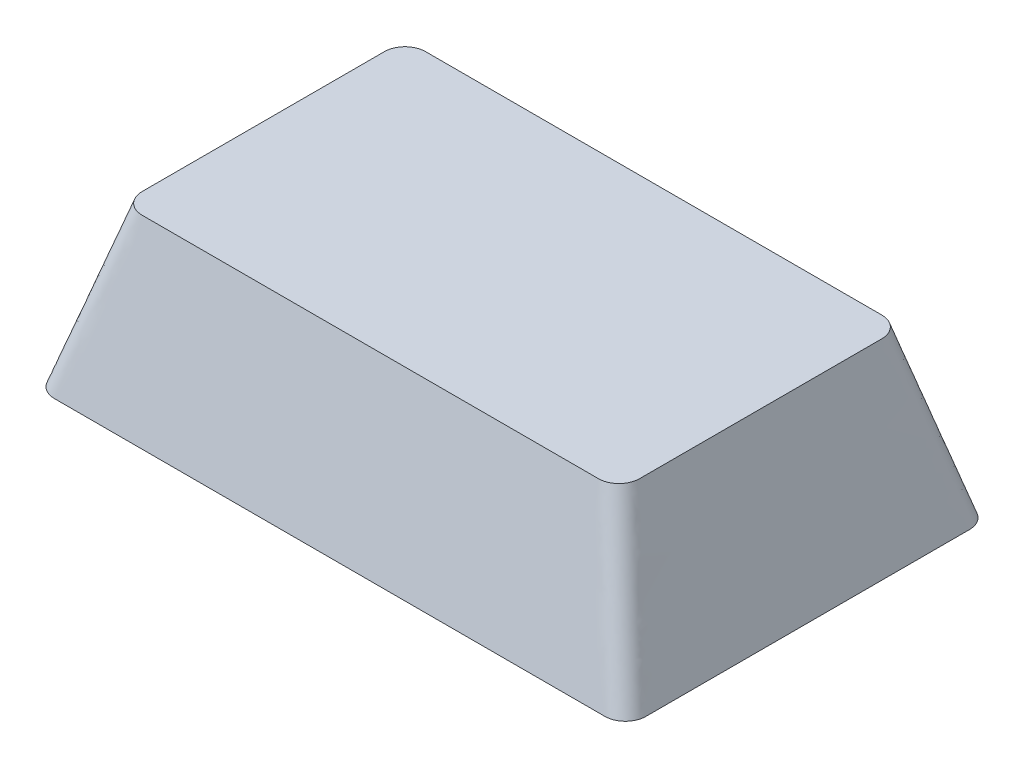
ISO-10303-21;
HEADER;
FILE_DESCRIPTION(('STEP AP214'),'2;1');
FILE_NAME('part.step','',(''),(''),'','','');
FILE_SCHEMA(('AUTOMOTIVE_DESIGN { 1 0 10303 214 1 1 1 1 }'));
ENDSEC;
DATA;
#1=APPLICATION_CONTEXT('core data for automotive mechanical design processes');
#2=APPLICATION_PROTOCOL_DEFINITION('international standard','automotive_design',2000,#1);
#3=PRODUCT_CONTEXT('',#1,'mechanical');
#4=PRODUCT('Part','Part','',(#3));
#5=PRODUCT_RELATED_PRODUCT_CATEGORY('part','',(#4));
#6=PRODUCT_DEFINITION_FORMATION('','',#4);
#7=PRODUCT_DEFINITION_CONTEXT('part definition',#1,'design');
#8=PRODUCT_DEFINITION('design','',#6,#7);
#9=PRODUCT_DEFINITION_SHAPE('','',#8);
#10=(LENGTH_UNIT() NAMED_UNIT(*) SI_UNIT(.MILLI.,.METRE.));
#11=(NAMED_UNIT(*) PLANE_ANGLE_UNIT() SI_UNIT($,.RADIAN.));
#12=(NAMED_UNIT(*) SI_UNIT($,.STERADIAN.) SOLID_ANGLE_UNIT());
#13=UNCERTAINTY_MEASURE_WITH_UNIT(LENGTH_MEASURE(1.E-05),#10,'distance_accuracy_value','');
#14=(GEOMETRIC_REPRESENTATION_CONTEXT(3) GLOBAL_UNCERTAINTY_ASSIGNED_CONTEXT((#13)) GLOBAL_UNIT_ASSIGNED_CONTEXT((#10,
#11,#12)) REPRESENTATION_CONTEXT('',''));
#15=CARTESIAN_POINT('',(0.,0.,0.));
#16=DIRECTION('',(0.,0.,1.));
#17=DIRECTION('',(1.,0.,0.));
#18=AXIS2_PLACEMENT_3D('',#15,#16,#17);
#19=CARTESIAN_POINT('',(-13.589,0.,-7.9883));
#20=DIRECTION('',(0.,-1.,0.));
#21=DIRECTION('',(0.,0.,-1.));
#22=AXIS2_PLACEMENT_3D('',#19,#20,#21);
#23=PLANE('',#22);
#24=CARTESIAN_POINT('',(-13.589,0.,-7.9883));
#25=DIRECTION('',(0.,1.,0.));
#26=DIRECTION('',(0.,0.,-1.));
#27=AXIS2_PLACEMENT_3D('',#24,#25,#26);
#28=CIRCLE('',#27,1.016);
#29=CARTESIAN_POINT('',(-13.5889999999092,0.,-9.0043));
#30=VERTEX_POINT('',#29);
#31=CARTESIAN_POINT('',(-14.605,0.,-7.9883));
#32=VERTEX_POINT('',#31);
#33=EDGE_CURVE('E308',#30,#32,#28,.T.);
#34=ORIENTED_EDGE('',*,*,#33,.F.);
#35=DIRECTION('',(-1.,0.,0.));
#36=VECTOR('',#35,1.);
#37=CARTESIAN_POINT('',(-13.589,0.,-9.0043));
#38=LINE('',#37,#36);
#39=CARTESIAN_POINT('',(13.5889999999258,0.,-9.0043));
#40=VERTEX_POINT('',#39);
#41=EDGE_CURVE('E540',#40,#30,#38,.T.);
#42=ORIENTED_EDGE('',*,*,#41,.F.);
#43=CARTESIAN_POINT('',(13.589,0.,-7.9883));
#44=DIRECTION('',(0.,1.,0.));
#45=DIRECTION('',(0.,0.,-1.));
#46=AXIS2_PLACEMENT_3D('',#43,#44,#45);
#47=CIRCLE('',#46,1.016);
#48=CARTESIAN_POINT('',(14.605,0.,-7.98829999987858));
#49=VERTEX_POINT('',#48);
#50=EDGE_CURVE('E531',#49,#40,#47,.T.);
#51=ORIENTED_EDGE('',*,*,#50,.F.);
#52=DIRECTION('',(0.,0.,-1.));
#53=VECTOR('',#52,1.);
#54=CARTESIAN_POINT('',(14.605,0.,7.9883));
#55=LINE('',#54,#53);
#56=CARTESIAN_POINT('',(14.605,0.,7.98829999997645));
#57=VERTEX_POINT('',#56);
#58=EDGE_CURVE('E522',#57,#49,#55,.T.);
#59=ORIENTED_EDGE('',*,*,#58,.F.);
#60=CARTESIAN_POINT('',(13.589,0.,7.9883));
#61=DIRECTION('',(0.,1.,0.));
#62=DIRECTION('',(0.,0.,1.));
#63=AXIS2_PLACEMENT_3D('',#60,#61,#62);
#64=CIRCLE('',#63,1.016);
#65=CARTESIAN_POINT('',(13.5889999999094,0.,9.0043));
#66=VERTEX_POINT('',#65);
#67=EDGE_CURVE('E513',#66,#57,#64,.T.);
#68=ORIENTED_EDGE('',*,*,#67,.F.);
#69=DIRECTION('',(1.,0.,0.));
#70=VECTOR('',#69,1.);
#71=CARTESIAN_POINT('',(-13.589,0.,9.0043));
#72=LINE('',#71,#70);
#73=CARTESIAN_POINT('',(-13.5889999999258,0.,9.0043));
#74=VERTEX_POINT('',#73);
#75=EDGE_CURVE('E507',#74,#66,#72,.T.);
#76=ORIENTED_EDGE('',*,*,#75,.F.);
#77=CARTESIAN_POINT('',(-13.589,0.,7.9883));
#78=DIRECTION('',(0.,1.,0.));
#79=DIRECTION('',(0.,0.,-1.));
#80=AXIS2_PLACEMENT_3D('',#77,#78,#79);
#81=CIRCLE('',#80,1.016);
#82=CARTESIAN_POINT('',(-14.605,0.,7.9883));
#83=VERTEX_POINT('',#82);
#84=EDGE_CURVE('E241',#83,#74,#81,.T.);
#85=ORIENTED_EDGE('',*,*,#84,.F.);
#86=DIRECTION('',(0.,0.,1.));
#87=VECTOR('',#86,1.);
#88=CARTESIAN_POINT('',(-14.605,0.,7.9883));
#89=LINE('',#88,#87);
#90=EDGE_CURVE('E12',#32,#83,#89,.T.);
#91=ORIENTED_EDGE('',*,*,#90,.F.);
#92=EDGE_LOOP('',(#34,#42,#51,#59,#68,#76,#85,#91));
#93=FACE_BOUND('',#92,.T.);
#94=ADVANCED_FACE('F231',(#93),#23,.T.);
#95=CARTESIAN_POINT('',(11.2649,8.001,-5.9817));
#96=DIRECTION('',(0.,-1.,0.));
#97=DIRECTION('',(0.,0.,-1.));
#98=AXIS2_PLACEMENT_3D('',#95,#96,#97);
#99=PLANE('',#98);
#100=CARTESIAN_POINT('',(11.2649,8.001,-5.9817));
#101=DIRECTION('',(0.,1.,0.));
#102=DIRECTION('',(0.,0.,-1.));
#103=AXIS2_PLACEMENT_3D('',#100,#101,#102);
#104=CIRCLE('',#103,1.016);
#105=CARTESIAN_POINT('',(12.2809,8.001,-5.9817));
#106=VERTEX_POINT('',#105);
#107=CARTESIAN_POINT('',(11.2649,8.001,-6.9977));
#108=VERTEX_POINT('',#107);
#109=EDGE_CURVE('E304',#106,#108,#104,.T.);
#110=ORIENTED_EDGE('',*,*,#109,.T.);
#111=DIRECTION('',(-1.,0.,0.));
#112=VECTOR('',#111,1.);
#113=CARTESIAN_POINT('',(-11.2649,8.001,-6.9977));
#114=LINE('',#113,#112);
#115=CARTESIAN_POINT('',(-11.2649,8.001,-6.9977));
#116=VERTEX_POINT('',#115);
#117=EDGE_CURVE('E296',#108,#116,#114,.T.);
#118=ORIENTED_EDGE('',*,*,#117,.T.);
#119=CARTESIAN_POINT('',(-11.2649,8.001,-5.9817));
#120=DIRECTION('',(0.,1.,0.));
#121=DIRECTION('',(0.,0.,-1.));
#122=AXIS2_PLACEMENT_3D('',#119,#120,#121);
#123=CIRCLE('',#122,1.016);
#124=CARTESIAN_POINT('',(-12.2809,8.001,-5.9817));
#125=VERTEX_POINT('',#124);
#126=EDGE_CURVE('E300',#116,#125,#123,.T.);
#127=ORIENTED_EDGE('',*,*,#126,.T.);
#128=DIRECTION('',(0.,0.,1.));
#129=VECTOR('',#128,1.);
#130=CARTESIAN_POINT('',(-12.2809,8.001,5.9817));
#131=LINE('',#130,#129);
#132=CARTESIAN_POINT('',(-12.2809,8.001,5.9817));
#133=VERTEX_POINT('',#132);
#134=EDGE_CURVE('E315',#125,#133,#131,.T.);
#135=ORIENTED_EDGE('',*,*,#134,.T.);
#136=CARTESIAN_POINT('',(-11.2649,8.001,5.9817));
#137=DIRECTION('',(0.,1.,0.));
#138=DIRECTION('',(0.,0.,-1.));
#139=AXIS2_PLACEMENT_3D('',#136,#137,#138);
#140=CIRCLE('',#139,1.016);
#141=CARTESIAN_POINT('',(-11.2649,8.001,6.9977));
#142=VERTEX_POINT('',#141);
#143=EDGE_CURVE('E439',#133,#142,#140,.T.);
#144=ORIENTED_EDGE('',*,*,#143,.T.);
#145=DIRECTION('',(1.,0.,0.));
#146=VECTOR('',#145,1.);
#147=CARTESIAN_POINT('',(-11.2649,8.001,6.9977));
#148=LINE('',#147,#146);
#149=CARTESIAN_POINT('',(11.2649,8.001,6.9977));
#150=VERTEX_POINT('',#149);
#151=EDGE_CURVE('E456',#142,#150,#148,.T.);
#152=ORIENTED_EDGE('',*,*,#151,.T.);
#153=CARTESIAN_POINT('',(11.2649,8.001,5.9817));
#154=DIRECTION('',(0.,1.,0.));
#155=DIRECTION('',(0.,0.,1.));
#156=AXIS2_PLACEMENT_3D('',#153,#154,#155);
#157=CIRCLE('',#156,1.016);
#158=CARTESIAN_POINT('',(12.2809,8.001,5.9817));
#159=VERTEX_POINT('',#158);
#160=EDGE_CURVE('E459',#150,#159,#157,.T.);
#161=ORIENTED_EDGE('',*,*,#160,.T.);
#162=DIRECTION('',(0.,0.,-1.));
#163=VECTOR('',#162,1.);
#164=CARTESIAN_POINT('',(12.2809,8.001,5.9817));
#165=LINE('',#164,#163);
#166=EDGE_CURVE('E477',#159,#106,#165,.T.);
#167=ORIENTED_EDGE('',*,*,#166,.T.);
#168=EDGE_LOOP('',(#110,#118,#127,#135,#144,#152,#161,#167));
#169=FACE_BOUND('',#168,.T.);
#170=ADVANCED_FACE('F299',(#169),#99,.F.);
#171=CARTESIAN_POINT('',(-11.264899999252,8.001,-6.9977));
#172=CARTESIAN_POINT('',(-13.5889999991079,0.,-9.0043));
#173=CARTESIAN_POINT('',(-9.37683942246574,8.001,-6.9977));
#174=CARTESIAN_POINT('',(-11.3371749471311,0.,-9.0043));
#175=CARTESIAN_POINT('',(-5.61671563890092,8.00100000000001,-6.9977));
#176=CARTESIAN_POINT('',(-6.81417926953772,0.,-9.0043));
#177=CARTESIAN_POINT('',(0.,8.00099999999999,-6.9977));
#178=CARTESIAN_POINT('',(0.,0.,-9.0043));
#179=CARTESIAN_POINT('',(5.61671563890092,8.00100000000001,-6.9977));
#180=CARTESIAN_POINT('',(6.81417926953772,0.,-9.0043));
#181=CARTESIAN_POINT('',(9.37683942246574,8.001,-6.9977));
#182=CARTESIAN_POINT('',(11.3371749471311,0.,-9.0043));
#183=CARTESIAN_POINT('',(11.3873168440045,8.001,-6.9977));
#184=CARTESIAN_POINT('',(13.7350023685164,0.,-9.0043));
#185=CARTESIAN_POINT('',(11.6496355695821,8.00099999999999,-6.95276310492376));
#186=CARTESIAN_POINT('',(14.000713128916,0.,-8.94347394699777));
#187=CARTESIAN_POINT('',(12.0131764314306,8.001,-6.71390648255491));
#188=CARTESIAN_POINT('',(14.3186746465909,0.,-8.72867923798697));
#189=CARTESIAN_POINT('',(12.2398827594691,8.001,-6.35141692796085));
#190=CARTESIAN_POINT('',(14.5396218938037,0.,-8.41182018643124));
#191=CARTESIAN_POINT('',(12.2809,8.001,-6.09910989594133));
#192=CARTESIAN_POINT('',(14.605,0.,-8.14046009575047));
#193=CARTESIAN_POINT('',(12.2809,8.001,-4.9691658077033));
#194=CARTESIAN_POINT('',(14.605,0.,-6.67608267440521));
#195=CARTESIAN_POINT('',(12.2809,8.00100000000001,-2.96800581755596));
#196=CARTESIAN_POINT('',(14.605,0.,-4.02352078936887));
#197=CARTESIAN_POINT('',(12.2809,8.00099999999999,0.));
#198=CARTESIAN_POINT('',(14.605,0.,0.));
#199=CARTESIAN_POINT('',(12.2809,8.001,2.96800581755596));
#200=CARTESIAN_POINT('',(14.605,0.,4.02352078936887));
#201=CARTESIAN_POINT('',(12.2809,8.001,4.9691658077033));
#202=CARTESIAN_POINT('',(14.605,0.,6.67608267440521));
#203=CARTESIAN_POINT('',(12.2809,8.001,6.09910989594133));
#204=CARTESIAN_POINT('',(14.605,0.,8.14046009575047));
#205=CARTESIAN_POINT('',(12.2398827594691,8.00100000000001,6.35141692796084));
#206=CARTESIAN_POINT('',(14.5396218938037,0.,8.41182018643125));
#207=CARTESIAN_POINT('',(12.0131764314306,8.00099999999999,6.71390648255492));
#208=CARTESIAN_POINT('',(14.3186746465909,0.,8.72867923798697));
#209=CARTESIAN_POINT('',(11.6496355695821,8.00100000000001,6.95276310492376));
#210=CARTESIAN_POINT('',(14.000713128916,0.,8.94347394699776));
#211=CARTESIAN_POINT('',(11.3873168440045,8.001,6.9977));
#212=CARTESIAN_POINT('',(13.7350023685164,0.,9.0043));
#213=CARTESIAN_POINT('',(9.37683942246574,8.001,6.9977));
#214=CARTESIAN_POINT('',(11.3371749471311,0.,9.0043));
#215=CARTESIAN_POINT('',(5.61671563890093,8.00100000000002,6.9977));
#216=CARTESIAN_POINT('',(6.81417926953771,0.,9.0043));
#217=CARTESIAN_POINT('',(0.,8.00099999999998,6.9977));
#218=CARTESIAN_POINT('',(0.,0.,9.0043));
#219=CARTESIAN_POINT('',(-5.61671563890091,8.00100000000001,6.9977));
#220=CARTESIAN_POINT('',(-6.81417926953773,0.,9.0043));
#221=CARTESIAN_POINT('',(-9.37683942246574,8.001,6.9977));
#222=CARTESIAN_POINT('',(-11.3371749471311,0.,9.0043));
#223=CARTESIAN_POINT('',(-11.3873168440045,8.001,6.9977));
#224=CARTESIAN_POINT('',(-13.7350023685164,0.,9.0043));
#225=CARTESIAN_POINT('',(-11.6496355695821,8.001,6.95276310492375));
#226=CARTESIAN_POINT('',(-14.000713128916,0.,8.94347394699776));
#227=CARTESIAN_POINT('',(-12.0131764314306,8.00099999999999,6.71390648255492));
#228=CARTESIAN_POINT('',(-14.3186746465909,0.,8.72867923798697));
#229=CARTESIAN_POINT('',(-12.2398827594691,8.001,6.35141692796084));
#230=CARTESIAN_POINT('',(-14.5396218938037,0.,8.41182018643125));
#231=CARTESIAN_POINT('',(-12.2809,8.001,6.09910989594133));
#232=CARTESIAN_POINT('',(-14.605,0.,8.14046009575047));
#233=CARTESIAN_POINT('',(-12.2809,8.001,4.9691658077033));
#234=CARTESIAN_POINT('',(-14.605,0.,6.67608267440522));
#235=CARTESIAN_POINT('',(-12.2809,8.00100000000001,2.96800581755597));
#236=CARTESIAN_POINT('',(-14.605,0.,4.02352078936887));
#237=CARTESIAN_POINT('',(-12.2809,8.00099999999999,0.));
#238=CARTESIAN_POINT('',(-14.605,0.,0.));
#239=CARTESIAN_POINT('',(-12.2809,8.00100000000001,-2.96800581755596));
#240=CARTESIAN_POINT('',(-14.605,0.,-4.02352078936887));
#241=CARTESIAN_POINT('',(-12.2809,8.001,-4.9691658077033));
#242=CARTESIAN_POINT('',(-14.605,0.,-6.67608267440522));
#243=CARTESIAN_POINT('',(-12.2809,8.001,-6.09910989594133));
#244=CARTESIAN_POINT('',(-14.605,0.,-8.14046009575047));
#245=CARTESIAN_POINT('',(-12.2398827594691,8.001,-6.35141692796084));
#246=CARTESIAN_POINT('',(-14.5396218938037,0.,-8.41182018643125));
#247=CARTESIAN_POINT('',(-12.0131764314306,8.001,-6.71390648255491));
#248=CARTESIAN_POINT('',(-14.3186746465909,0.,-8.72867923798697));
#249=CARTESIAN_POINT('',(-11.6496355695821,8.001,-6.95276310492376));
#250=CARTESIAN_POINT('',(-14.000713128916,0.,-8.94347394699776));
#251=CARTESIAN_POINT('',(-11.3873168440045,8.001,-6.9977));
#252=CARTESIAN_POINT('',(-13.7350023685164,0.,-9.0043));
#253=CARTESIAN_POINT('',(-11.264899999252,8.001,-6.9977));
#254=CARTESIAN_POINT('',(-13.5889999991079,0.,-9.0043));
#255=B_SPLINE_SURFACE_WITH_KNOTS('',3,1,((#171,#172),(#173,#174),(#175,#176),(#177,#178),(#179,
#180),(#181,#182),(#183,#184),(#185,#186),(#187,#188),(#189,#190),(#191,#192),(#193,#194),(#195,
#196),(#197,#198),(#199,#200),(#201,#202),(#203,#204),(#205,#206),(#207,#208),(#209,#210),(#211,
#212),(#213,#214),(#215,#216),(#217,#218),(#219,#220),(#221,#222),(#223,#224),(#225,#226),(#227,
#228),(#229,#230),(#231,#232),(#233,#234),(#235,#236),(#237,#238),(#239,#240),(#241,#242),(#243,
#244),(#245,#246),(#247,#248),(#249,#250),(#251,#252),(#253,#254)),.UNSPECIFIED.,.T.,.F.,.F.,(4,
1,1,1,2,1,1,1,2,1,1,1,2,1,1,1,2,1,1,1,2,1,1,1,2,1,1,1,2,1,1,1,4),(2,2),(0.,0.0740158626334952,
0.14803172526699,0.222047587900486,0.296063450533981,0.30086244293742,0.305661435340859,
0.310460427744298,0.315259420147737,0.356645572707364,0.39803172526699,0.439417877826617,
0.480804030386244,0.485603022789683,0.490402015193122,0.495201007596561,0.5,0.574015862633495,
0.64803172526699,0.722047587900486,0.796063450533981,0.80086244293742,0.805661435340859,
0.810460427744298,0.815259420147737,0.856645572707364,0.89803172526699,0.939417877826617,
0.980804030386244,0.985603022789683,0.990402015193122,0.995201007596561,1.),(0.,1.),.UNSPECIFIED.);
#256=ORIENTED_EDGE('',*,*,#109,.F.);
#257=ORIENTED_EDGE('',*,*,#166,.F.);
#258=ORIENTED_EDGE('',*,*,#160,.F.);
#259=ORIENTED_EDGE('',*,*,#151,.F.);
#260=ORIENTED_EDGE('',*,*,#143,.F.);
#261=ORIENTED_EDGE('',*,*,#134,.F.);
#262=ORIENTED_EDGE('',*,*,#126,.F.);
#263=ORIENTED_EDGE('',*,*,#117,.F.);
#264=EDGE_LOOP('',(#256,#257,#258,#259,#260,#261,#262,#263));
#265=FACE_BOUND('',#264,.T.);
#266=ORIENTED_EDGE('',*,*,#90,.T.);
#267=ORIENTED_EDGE('',*,*,#84,.T.);
#268=ORIENTED_EDGE('',*,*,#75,.T.);
#269=ORIENTED_EDGE('',*,*,#67,.T.);
#270=ORIENTED_EDGE('',*,*,#58,.T.);
#271=ORIENTED_EDGE('',*,*,#50,.T.);
#272=ORIENTED_EDGE('',*,*,#41,.T.);
#273=ORIENTED_EDGE('',*,*,#33,.T.);
#274=EDGE_LOOP('',(#266,#267,#268,#269,#270,#271,#272,#273));
#275=FACE_BOUND('',#274,.T.);
#276=ADVANCED_FACE('F313',(#265,#275),#255,.T.);
#277=CLOSED_SHELL('',(#94,#170,#276));
#278=MANIFOLD_SOLID_BREP('B2',#277);
#279=ADVANCED_BREP_SHAPE_REPRESENTATION('',(#18,#278),#14);
#280=SHAPE_DEFINITION_REPRESENTATION(#9,#279);
ENDSEC;
END-ISO-10303-21;
